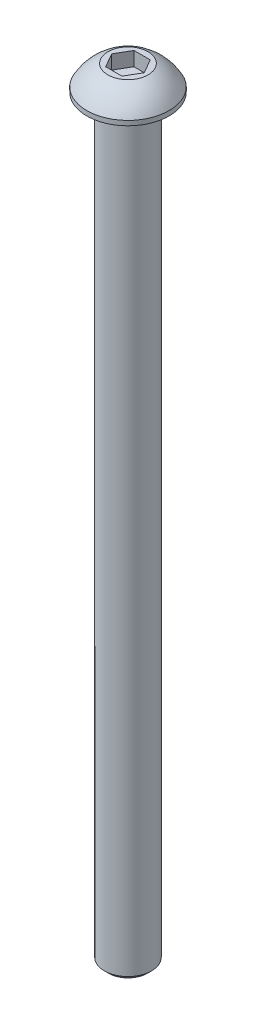
ISO-10303-21;
HEADER;
FILE_DESCRIPTION(('STEP AP214'),'2;1');
FILE_NAME('part.step','',(''),(''),'','','');
FILE_SCHEMA(('AUTOMOTIVE_DESIGN { 1 0 10303 214 1 1 1 1 }'));
ENDSEC;
DATA;
#1=APPLICATION_CONTEXT('core data for automotive mechanical design processes');
#2=APPLICATION_PROTOCOL_DEFINITION('international standard','automotive_design',2000,#1);
#3=PRODUCT_CONTEXT('',#1,'mechanical');
#4=PRODUCT('Part','Part','',(#3));
#5=PRODUCT_RELATED_PRODUCT_CATEGORY('part','',(#4));
#6=PRODUCT_DEFINITION_FORMATION('','',#4);
#7=PRODUCT_DEFINITION_CONTEXT('part definition',#1,'design');
#8=PRODUCT_DEFINITION('design','',#6,#7);
#9=PRODUCT_DEFINITION_SHAPE('','',#8);
#10=(LENGTH_UNIT() NAMED_UNIT(*) SI_UNIT(.MILLI.,.METRE.));
#11=(NAMED_UNIT(*) PLANE_ANGLE_UNIT() SI_UNIT($,.RADIAN.));
#12=(NAMED_UNIT(*) SI_UNIT($,.STERADIAN.) SOLID_ANGLE_UNIT());
#13=UNCERTAINTY_MEASURE_WITH_UNIT(LENGTH_MEASURE(1.E-05),#10,'distance_accuracy_value','');
#14=(GEOMETRIC_REPRESENTATION_CONTEXT(3) GLOBAL_UNCERTAINTY_ASSIGNED_CONTEXT((#13)) GLOBAL_UNIT_ASSIGNED_CONTEXT((#10,
#11,#12)) REPRESENTATION_CONTEXT('',''));
#15=CARTESIAN_POINT('',(0.,0.,0.));
#16=DIRECTION('',(0.,0.,1.));
#17=DIRECTION('',(1.,0.,0.));
#18=AXIS2_PLACEMENT_3D('',#15,#16,#17);
#19=CARTESIAN_POINT('',(0.,-127.,0.));
#20=DIRECTION('',(0.,1.,0.));
#21=DIRECTION('',(-1.,0.,0.));
#22=AXIS2_PLACEMENT_3D('',#19,#20,#21);
#23=PLANE('',#22);
#24=CARTESIAN_POINT('',(0.,-127.,0.));
#25=DIRECTION('',(0.,1.,0.));
#26=DIRECTION('',(-1.,0.,0.));
#27=AXIS2_PLACEMENT_3D('',#24,#25,#26);
#28=CIRCLE('',#27,3.26319444444443);
#29=CARTESIAN_POINT('',(-3.26319444444441,-127.,0.));
#30=VERTEX_POINT('',#29);
#31=EDGE_CURVE('E11',#30,#30,#28,.T.);
#32=ORIENTED_EDGE('',*,*,#31,.F.);
#33=EDGE_LOOP('',(#32));
#34=FACE_BOUND('',#33,.T.);
#35=ADVANCED_FACE('F33',(#34),#23,.F.);
#36=CARTESIAN_POINT('',(0.,-127.,0.));
#37=DIRECTION('',(0.,1.,0.));
#38=DIRECTION('',(-1.,0.,0.));
#39=AXIS2_PLACEMENT_3D('',#36,#37,#38);
#40=CONICAL_SURFACE('',#39,3.26319444444443,0.785398163397477);
#41=CARTESIAN_POINT('',(0.,-126.294444444444,0.));
#42=DIRECTION('',(0.,1.,0.));
#43=DIRECTION('',(-1.,0.,0.));
#44=AXIS2_PLACEMENT_3D('',#41,#42,#43);
#45=CIRCLE('',#44,3.96874999999999);
#46=CARTESIAN_POINT('',(-3.96874999999997,-126.294444444444,0.));
#47=VERTEX_POINT('',#46);
#48=EDGE_CURVE('E40',#47,#47,#45,.T.);
#49=ORIENTED_EDGE('',*,*,#48,.F.);
#50=EDGE_LOOP('',(#49));
#51=FACE_BOUND('',#50,.T.);
#52=ORIENTED_EDGE('',*,*,#31,.T.);
#53=EDGE_LOOP('',(#52));
#54=FACE_BOUND('',#53,.T.);
#55=ADVANCED_FACE('F155',(#51,#54),#40,.T.);
#56=CARTESIAN_POINT('',(0.,69.088,0.));
#57=DIRECTION('',(0.,1.,0.));
#58=DIRECTION('',(-1.,0.,0.));
#59=AXIS2_PLACEMENT_3D('',#56,#57,#58);
#60=CYLINDRICAL_SURFACE('',#59,3.96875);
#61=CARTESIAN_POINT('',(0.,0.,0.));
#62=DIRECTION('',(0.,1.,0.));
#63=DIRECTION('',(-1.,0.,0.));
#64=AXIS2_PLACEMENT_3D('',#61,#62,#63);
#65=CIRCLE('',#64,3.96875);
#66=CARTESIAN_POINT('',(-3.96874999999999,0.,0.));
#67=VERTEX_POINT('',#66);
#68=EDGE_CURVE('E148',#67,#67,#65,.T.);
#69=ORIENTED_EDGE('',*,*,#68,.F.);
#70=EDGE_LOOP('',(#69));
#71=FACE_BOUND('',#70,.T.);
#72=ORIENTED_EDGE('',*,*,#48,.T.);
#73=EDGE_LOOP('',(#72));
#74=FACE_BOUND('',#73,.T.);
#75=ADVANCED_FACE('F153',(#71,#74),#60,.T.);
#76=CARTESIAN_POINT('',(3.96875000000001,0.,0.));
#77=DIRECTION('',(0.,1.,0.));
#78=DIRECTION('',(-1.,0.,0.));
#79=AXIS2_PLACEMENT_3D('',#76,#77,#78);
#80=PLANE('',#79);
#81=CARTESIAN_POINT('',(0.,0.,0.));
#82=DIRECTION('',(0.,1.,0.));
#83=DIRECTION('',(-1.,0.,0.));
#84=AXIS2_PLACEMENT_3D('',#81,#82,#83);
#85=CIRCLE('',#84,6.9469);
#86=CARTESIAN_POINT('',(-6.94689999999999,0.,0.));
#87=VERTEX_POINT('',#86);
#88=EDGE_CURVE('E145',#87,#87,#85,.T.);
#89=ORIENTED_EDGE('',*,*,#88,.F.);
#90=EDGE_LOOP('',(#89));
#91=FACE_BOUND('',#90,.T.);
#92=ORIENTED_EDGE('',*,*,#68,.T.);
#93=EDGE_LOOP('',(#92));
#94=FACE_BOUND('',#93,.T.);
#95=ADVANCED_FACE('F173',(#91,#94),#80,.F.);
#96=CARTESIAN_POINT('',(0.,69.088,0.));
#97=DIRECTION('',(0.,1.,0.));
#98=DIRECTION('',(-1.,0.,0.));
#99=AXIS2_PLACEMENT_3D('',#96,#97,#98);
#100=CYLINDRICAL_SURFACE('',#99,6.9469);
#101=CARTESIAN_POINT('',(0.,0.787399999999994,0.));
#102=DIRECTION('',(0.,1.,0.));
#103=DIRECTION('',(-1.,0.,0.));
#104=AXIS2_PLACEMENT_3D('',#101,#102,#103);
#105=CIRCLE('',#104,6.9469);
#106=CARTESIAN_POINT('',(-6.94689999999999,0.787399999999993,0.));
#107=VERTEX_POINT('',#106);
#108=EDGE_CURVE('E142',#107,#107,#105,.T.);
#109=ORIENTED_EDGE('',*,*,#108,.F.);
#110=EDGE_LOOP('',(#109));
#111=FACE_BOUND('',#110,.T.);
#112=ORIENTED_EDGE('',*,*,#88,.T.);
#113=EDGE_LOOP('',(#112));
#114=FACE_BOUND('',#113,.T.);
#115=ADVANCED_FACE('F181',(#111,#114),#100,.T.);
#116=CARTESIAN_POINT('',(0.,-2.86463469314528,0.));
#117=DIRECTION('',(0.,1.,0.));
#118=DIRECTION('',(1.,0.,0.));
#119=AXIS2_PLACEMENT_3D('',#116,#117,#118);
#120=SPHERICAL_SURFACE('',#119,7.84836142197444);
#121=CARTESIAN_POINT('',(0.,4.21639999999999,0.));
#122=DIRECTION('',(0.,1.,0.));
#123=DIRECTION('',(-1.,0.,0.));
#124=AXIS2_PLACEMENT_3D('',#121,#122,#123);
#125=CIRCLE('',#124,3.38463065701558);
#126=CARTESIAN_POINT('',(-3.38463065701557,4.21639999999999,0.));
#127=VERTEX_POINT('',#126);
#128=EDGE_CURVE('E134',#127,#127,#125,.T.);
#129=ORIENTED_EDGE('',*,*,#128,.F.);
#130=EDGE_LOOP('',(#129));
#131=FACE_BOUND('',#130,.T.);
#132=ORIENTED_EDGE('',*,*,#108,.T.);
#133=EDGE_LOOP('',(#132));
#134=FACE_BOUND('',#133,.T.);
#135=ADVANCED_FACE('F189',(#131,#134),#120,.T.);
#136=CARTESIAN_POINT('',(3.38463065701558,4.2164,0.));
#137=DIRECTION('',(0.,-1.,0.));
#138=DIRECTION('',(1.,0.,0.));
#139=AXIS2_PLACEMENT_3D('',#136,#137,#138);
#140=PLANE('',#139);
#141=DIRECTION('',(-0.5,0.,-0.866025403784439));
#142=VECTOR('',#141,1.);
#143=CARTESIAN_POINT('',(2.74963065701558,4.2164,0.));
#144=LINE('',#143,#142);
#145=CARTESIAN_POINT('',(2.74963065701558,4.2164,0.));
#146=VERTEX_POINT('',#145);
#147=CARTESIAN_POINT('',(1.37481532850779,4.2164,-2.38124999999999));
#148=VERTEX_POINT('',#147);
#149=EDGE_CURVE('E121',#146,#148,#144,.T.);
#150=ORIENTED_EDGE('',*,*,#149,.F.);
#151=DIRECTION('',(0.5,0.,-0.866025403784439));
#152=VECTOR('',#151,1.);
#153=CARTESIAN_POINT('',(1.37481532850779,4.2164,2.38124999999999));
#154=LINE('',#153,#152);
#155=CARTESIAN_POINT('',(1.37481532850779,4.2164,2.38124999999999));
#156=VERTEX_POINT('',#155);
#157=EDGE_CURVE('E47',#156,#146,#154,.T.);
#158=ORIENTED_EDGE('',*,*,#157,.F.);
#159=DIRECTION('',(1.,0.,0.));
#160=VECTOR('',#159,1.);
#161=CARTESIAN_POINT('',(-1.37481532850779,4.2164,2.38124999999999));
#162=LINE('',#161,#160);
#163=CARTESIAN_POINT('',(-1.37481532850779,4.2164,2.38124999999999));
#164=VERTEX_POINT('',#163);
#165=EDGE_CURVE('E130',#164,#156,#162,.T.);
#166=ORIENTED_EDGE('',*,*,#165,.F.);
#167=DIRECTION('',(0.5,0.,0.866025403784439));
#168=VECTOR('',#167,1.);
#169=CARTESIAN_POINT('',(-2.74963065701559,4.2164,0.));
#170=LINE('',#169,#168);
#171=CARTESIAN_POINT('',(-2.74963065701559,4.2164,0.));
#172=VERTEX_POINT('',#171);
#173=EDGE_CURVE('E128',#172,#164,#170,.T.);
#174=ORIENTED_EDGE('',*,*,#173,.F.);
#175=DIRECTION('',(-0.5,0.,0.866025403784439));
#176=VECTOR('',#175,1.);
#177=CARTESIAN_POINT('',(-1.37481532850779,4.2164,-2.38124999999999));
#178=LINE('',#177,#176);
#179=CARTESIAN_POINT('',(-1.37481532850779,4.2164,-2.38124999999999));
#180=VERTEX_POINT('',#179);
#181=EDGE_CURVE('E95',#180,#172,#178,.T.);
#182=ORIENTED_EDGE('',*,*,#181,.F.);
#183=DIRECTION('',(-1.,0.,0.));
#184=VECTOR('',#183,1.);
#185=CARTESIAN_POINT('',(1.37481532850779,4.2164,-2.38124999999999));
#186=LINE('',#185,#184);
#187=EDGE_CURVE('E124',#148,#180,#186,.T.);
#188=ORIENTED_EDGE('',*,*,#187,.F.);
#189=EDGE_LOOP('',(#150,#158,#166,#174,#182,#188));
#190=FACE_BOUND('',#189,.T.);
#191=ORIENTED_EDGE('',*,*,#128,.T.);
#192=EDGE_LOOP('',(#191));
#193=FACE_BOUND('',#192,.T.);
#194=ADVANCED_FACE('F197',(#190,#193),#140,.F.);
#195=CARTESIAN_POINT('',(1.37481532850779,1.83515,2.38124999999999));
#196=DIRECTION('',(0.866025403784439,0.,0.5));
#197=DIRECTION('',(0.5,0.,-0.866025403784439));
#198=AXIS2_PLACEMENT_3D('',#195,#196,#197);
#199=PLANE('',#198);
#200=ORIENTED_EDGE('',*,*,#157,.T.);
#201=DIRECTION('',(0.,1.,0.));
#202=VECTOR('',#201,1.);
#203=CARTESIAN_POINT('',(2.74963065701558,1.83515,0.));
#204=LINE('',#203,#202);
#205=CARTESIAN_POINT('',(2.74963065701558,1.83515,0.));
#206=VERTEX_POINT('',#205);
#207=EDGE_CURVE('E77',#206,#146,#204,.T.);
#208=ORIENTED_EDGE('',*,*,#207,.F.);
#209=DIRECTION('',(0.5,0.,-0.866025403784439));
#210=VECTOR('',#209,1.);
#211=CARTESIAN_POINT('',(1.37481532850779,1.83515,2.38124999999999));
#212=LINE('',#211,#210);
#213=CARTESIAN_POINT('',(1.37481532850779,1.83515,2.38124999999999));
#214=VERTEX_POINT('',#213);
#215=EDGE_CURVE('E132',#214,#206,#212,.T.);
#216=ORIENTED_EDGE('',*,*,#215,.F.);
#217=DIRECTION('',(0.,1.,0.));
#218=VECTOR('',#217,1.);
#219=CARTESIAN_POINT('',(1.37481532850779,1.83515,2.38124999999999));
#220=LINE('',#219,#218);
#221=EDGE_CURVE('E55',#214,#156,#220,.T.);
#222=ORIENTED_EDGE('',*,*,#221,.T.);
#223=EDGE_LOOP('',(#200,#208,#216,#222));
#224=FACE_BOUND('',#223,.T.);
#225=ADVANCED_FACE('F205',(#224),#199,.F.);
#226=CARTESIAN_POINT('',(-1.37481532850779,1.83515,2.38124999999999));
#227=DIRECTION('',(0.,0.,1.));
#228=DIRECTION('',(1.,0.,0.));
#229=AXIS2_PLACEMENT_3D('',#226,#227,#228);
#230=PLANE('',#229);
#231=ORIENTED_EDGE('',*,*,#165,.T.);
#232=ORIENTED_EDGE('',*,*,#221,.F.);
#233=DIRECTION('',(1.,0.,0.));
#234=VECTOR('',#233,1.);
#235=CARTESIAN_POINT('',(-1.37481532850779,1.83515,2.38124999999999));
#236=LINE('',#235,#234);
#237=CARTESIAN_POINT('',(-1.37481532850779,1.83515,2.38124999999999));
#238=VERTEX_POINT('',#237);
#239=EDGE_CURVE('E107',#238,#214,#236,.T.);
#240=ORIENTED_EDGE('',*,*,#239,.F.);
#241=DIRECTION('',(0.,1.,0.));
#242=VECTOR('',#241,1.);
#243=CARTESIAN_POINT('',(-1.37481532850779,1.83515,2.38124999999999));
#244=LINE('',#243,#242);
#245=EDGE_CURVE('E99',#238,#164,#244,.T.);
#246=ORIENTED_EDGE('',*,*,#245,.T.);
#247=EDGE_LOOP('',(#231,#232,#240,#246));
#248=FACE_BOUND('',#247,.T.);
#249=ADVANCED_FACE('F213',(#248),#230,.F.);
#250=CARTESIAN_POINT('',(-2.74963065701559,1.83515,0.));
#251=DIRECTION('',(-0.866025403784439,0.,0.5));
#252=DIRECTION('',(0.5,0.,0.866025403784439));
#253=AXIS2_PLACEMENT_3D('',#250,#251,#252);
#254=PLANE('',#253);
#255=ORIENTED_EDGE('',*,*,#173,.T.);
#256=ORIENTED_EDGE('',*,*,#245,.F.);
#257=DIRECTION('',(0.5,0.,0.866025403784439));
#258=VECTOR('',#257,1.);
#259=CARTESIAN_POINT('',(-2.74963065701559,1.83515,0.));
#260=LINE('',#259,#258);
#261=CARTESIAN_POINT('',(-2.74963065701559,1.83515,0.));
#262=VERTEX_POINT('',#261);
#263=EDGE_CURVE('E103',#262,#238,#260,.T.);
#264=ORIENTED_EDGE('',*,*,#263,.F.);
#265=DIRECTION('',(0.,1.,0.));
#266=VECTOR('',#265,1.);
#267=CARTESIAN_POINT('',(-2.74963065701559,1.83515,0.));
#268=LINE('',#267,#266);
#269=EDGE_CURVE('E88',#262,#172,#268,.T.);
#270=ORIENTED_EDGE('',*,*,#269,.T.);
#271=EDGE_LOOP('',(#255,#256,#264,#270));
#272=FACE_BOUND('',#271,.T.);
#273=ADVANCED_FACE('F104',(#272),#254,.F.);
#274=CARTESIAN_POINT('',(-1.37481532850779,1.83515,-2.38124999999999));
#275=DIRECTION('',(-0.866025403784439,0.,-0.5));
#276=DIRECTION('',(-0.5,0.,0.866025403784438));
#277=AXIS2_PLACEMENT_3D('',#274,#275,#276);
#278=PLANE('',#277);
#279=ORIENTED_EDGE('',*,*,#181,.T.);
#280=ORIENTED_EDGE('',*,*,#269,.F.);
#281=DIRECTION('',(-0.5,0.,0.866025403784439));
#282=VECTOR('',#281,1.);
#283=CARTESIAN_POINT('',(-1.37481532850779,1.83515,-2.38124999999999));
#284=LINE('',#283,#282);
#285=CARTESIAN_POINT('',(-1.37481532850779,1.83515,-2.38124999999999));
#286=VERTEX_POINT('',#285);
#287=EDGE_CURVE('E92',#286,#262,#284,.T.);
#288=ORIENTED_EDGE('',*,*,#287,.F.);
#289=DIRECTION('',(0.,1.,0.));
#290=VECTOR('',#289,1.);
#291=CARTESIAN_POINT('',(-1.37481532850779,1.83515,-2.38124999999999));
#292=LINE('',#291,#290);
#293=EDGE_CURVE('E100',#286,#180,#292,.T.);
#294=ORIENTED_EDGE('',*,*,#293,.T.);
#295=EDGE_LOOP('',(#279,#280,#288,#294));
#296=FACE_BOUND('',#295,.T.);
#297=ADVANCED_FACE('F90',(#296),#278,.F.);
#298=CARTESIAN_POINT('',(1.37481532850779,1.83515,-2.38124999999999));
#299=DIRECTION('',(0.,0.,-1.));
#300=DIRECTION('',(-1.,0.,0.));
#301=AXIS2_PLACEMENT_3D('',#298,#299,#300);
#302=PLANE('',#301);
#303=ORIENTED_EDGE('',*,*,#187,.T.);
#304=ORIENTED_EDGE('',*,*,#293,.F.);
#305=DIRECTION('',(-1.,0.,0.));
#306=VECTOR('',#305,1.);
#307=CARTESIAN_POINT('',(1.37481532850779,1.83515,-2.38124999999999));
#308=LINE('',#307,#306);
#309=CARTESIAN_POINT('',(1.37481532850779,1.83515,-2.38124999999999));
#310=VERTEX_POINT('',#309);
#311=EDGE_CURVE('E113',#310,#286,#308,.T.);
#312=ORIENTED_EDGE('',*,*,#311,.F.);
#313=DIRECTION('',(0.,1.,0.));
#314=VECTOR('',#313,1.);
#315=CARTESIAN_POINT('',(1.37481532850779,1.83515,-2.38124999999999));
#316=LINE('',#315,#314);
#317=EDGE_CURVE('E137',#310,#148,#316,.T.);
#318=ORIENTED_EDGE('',*,*,#317,.T.);
#319=EDGE_LOOP('',(#303,#304,#312,#318));
#320=FACE_BOUND('',#319,.T.);
#321=ADVANCED_FACE('F232',(#320),#302,.F.);
#322=CARTESIAN_POINT('',(2.74963065701558,1.83515,0.));
#323=DIRECTION('',(0.866025403784439,0.,-0.5));
#324=DIRECTION('',(-0.5,0.,-0.866025403784439));
#325=AXIS2_PLACEMENT_3D('',#322,#323,#324);
#326=PLANE('',#325);
#327=ORIENTED_EDGE('',*,*,#149,.T.);
#328=ORIENTED_EDGE('',*,*,#317,.F.);
#329=DIRECTION('',(-0.5,0.,-0.866025403784439));
#330=VECTOR('',#329,1.);
#331=CARTESIAN_POINT('',(2.74963065701558,1.83515,0.));
#332=LINE('',#331,#330);
#333=EDGE_CURVE('E115',#206,#310,#332,.T.);
#334=ORIENTED_EDGE('',*,*,#333,.F.);
#335=ORIENTED_EDGE('',*,*,#207,.T.);
#336=EDGE_LOOP('',(#327,#328,#334,#335));
#337=FACE_BOUND('',#336,.T.);
#338=ADVANCED_FACE('F239',(#337),#326,.F.);
#339=CARTESIAN_POINT('',(4.12444598552338,1.83515,-2.38124999999999));
#340=DIRECTION('',(0.,1.,0.));
#341=DIRECTION('',(0.,0.,1.));
#342=AXIS2_PLACEMENT_3D('',#339,#340,#341);
#343=PLANE('',#342);
#344=ORIENTED_EDGE('',*,*,#215,.T.);
#345=ORIENTED_EDGE('',*,*,#333,.T.);
#346=ORIENTED_EDGE('',*,*,#311,.T.);
#347=ORIENTED_EDGE('',*,*,#287,.T.);
#348=ORIENTED_EDGE('',*,*,#263,.T.);
#349=ORIENTED_EDGE('',*,*,#239,.T.);
#350=EDGE_LOOP('',(#344,#345,#346,#347,#348,#349));
#351=FACE_BOUND('',#350,.T.);
#352=ADVANCED_FACE('F110',(#351),#343,.T.);
#353=CLOSED_SHELL('',(#35,#55,#75,#95,#115,#135,#194,#225,#249,#273,#297,#321,#338,#352));
#354=MANIFOLD_SOLID_BREP('B2',#353);
#355=ADVANCED_BREP_SHAPE_REPRESENTATION('',(#18,#354),#14);
#356=SHAPE_DEFINITION_REPRESENTATION(#9,#355);
ENDSEC;
END-ISO-10303-21;
